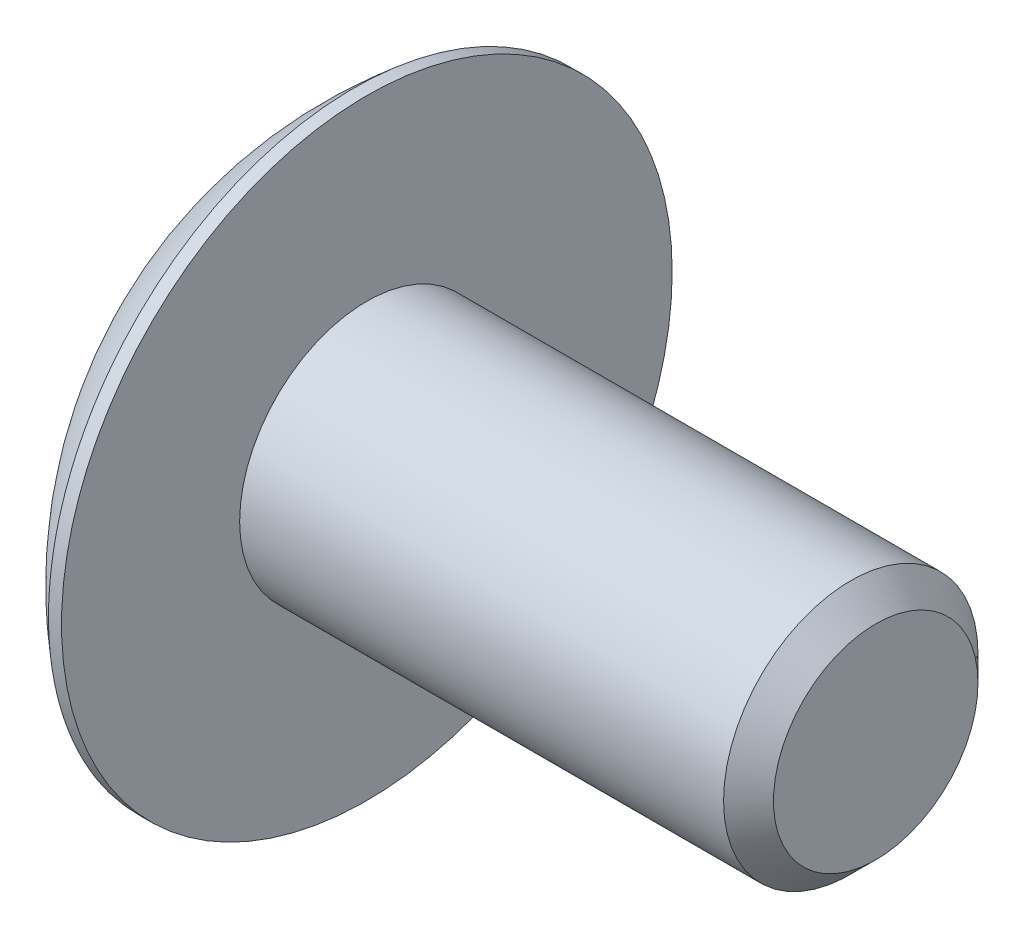
ISO-10303-21;
HEADER;
FILE_DESCRIPTION(('STEP AP214'),'2;1');
FILE_NAME('part.step','',(''),(''),'','','');
FILE_SCHEMA(('AUTOMOTIVE_DESIGN { 1 0 10303 214 1 1 1 1 }'));
ENDSEC;
DATA;
#1=APPLICATION_CONTEXT('core data for automotive mechanical design processes');
#2=APPLICATION_PROTOCOL_DEFINITION('international standard','automotive_design',2000,#1);
#3=PRODUCT_CONTEXT('',#1,'mechanical');
#4=PRODUCT('Part','Part','',(#3));
#5=PRODUCT_RELATED_PRODUCT_CATEGORY('part','',(#4));
#6=PRODUCT_DEFINITION_FORMATION('','',#4);
#7=PRODUCT_DEFINITION_CONTEXT('part definition',#1,'design');
#8=PRODUCT_DEFINITION('design','',#6,#7);
#9=PRODUCT_DEFINITION_SHAPE('','',#8);
#10=(LENGTH_UNIT() NAMED_UNIT(*) SI_UNIT(.MILLI.,.METRE.));
#11=(NAMED_UNIT(*) PLANE_ANGLE_UNIT() SI_UNIT($,.RADIAN.));
#12=(NAMED_UNIT(*) SI_UNIT($,.STERADIAN.) SOLID_ANGLE_UNIT());
#13=UNCERTAINTY_MEASURE_WITH_UNIT(LENGTH_MEASURE(1.E-05),#10,'distance_accuracy_value','');
#14=(GEOMETRIC_REPRESENTATION_CONTEXT(3) GLOBAL_UNCERTAINTY_ASSIGNED_CONTEXT((#13)) GLOBAL_UNIT_ASSIGNED_CONTEXT((#10,
#11,#12)) REPRESENTATION_CONTEXT('',''));
#15=CARTESIAN_POINT('',(0.,0.,0.));
#16=DIRECTION('',(0.,0.,1.));
#17=DIRECTION('',(1.,0.,0.));
#18=AXIS2_PLACEMENT_3D('',#15,#16,#17);
#19=CARTESIAN_POINT('',(0.,0.,0.));
#20=DIRECTION('',(-1.,0.,0.));
#21=DIRECTION('',(0.,0.,1.));
#22=AXIS2_PLACEMENT_3D('',#19,#20,#21);
#23=CYLINDRICAL_SURFACE('',#22,6.);
#24=CARTESIAN_POINT('',(0.,0.,0.));
#25=DIRECTION('',(1.,0.,0.));
#26=DIRECTION('',(0.,0.,-1.));
#27=AXIS2_PLACEMENT_3D('',#24,#25,#26);
#28=CIRCLE('',#27,6.);
#29=CARTESIAN_POINT('',(0.,0.,-6.));
#30=VERTEX_POINT('',#29);
#31=EDGE_CURVE('E199',#30,#30,#28,.T.);
#32=ORIENTED_EDGE('',*,*,#31,.F.);
#33=EDGE_LOOP('',(#32));
#34=FACE_BOUND('',#33,.T.);
#35=CARTESIAN_POINT('',(-0.25535421758715,0.,0.));
#36=DIRECTION('',(1.,0.,0.));
#37=DIRECTION('',(0.,0.,-1.));
#38=AXIS2_PLACEMENT_3D('',#35,#36,#37);
#39=CIRCLE('',#38,6.);
#40=CARTESIAN_POINT('',(-0.25535421758715,0.,-6.));
#41=VERTEX_POINT('',#40);
#42=EDGE_CURVE('E198',#41,#41,#39,.T.);
#43=ORIENTED_EDGE('',*,*,#42,.T.);
#44=EDGE_LOOP('',(#43));
#45=FACE_BOUND('',#44,.T.);
#46=ADVANCED_FACE('F40',(#34,#45),#23,.T.);
#47=CARTESIAN_POINT('',(0.,0.,0.));
#48=DIRECTION('',(1.,0.,0.));
#49=DIRECTION('',(0.,0.,-1.));
#50=AXIS2_PLACEMENT_3D('',#47,#48,#49);
#51=PLANE('',#50);
#52=CARTESIAN_POINT('',(0.,0.,0.));
#53=DIRECTION('',(1.,0.,0.));
#54=DIRECTION('',(0.,0.,-1.));
#55=AXIS2_PLACEMENT_3D('',#52,#53,#54);
#56=CIRCLE('',#55,2.5);
#57=CARTESIAN_POINT('',(0.,0.,-2.5));
#58=VERTEX_POINT('',#57);
#59=EDGE_CURVE('E176',#58,#58,#56,.T.);
#60=ORIENTED_EDGE('',*,*,#59,.F.);
#61=EDGE_LOOP('',(#60));
#62=FACE_BOUND('',#61,.T.);
#63=ORIENTED_EDGE('',*,*,#31,.T.);
#64=EDGE_LOOP('',(#63));
#65=FACE_BOUND('',#64,.T.);
#66=ADVANCED_FACE('F214',(#62,#65),#51,.T.);
#67=CARTESIAN_POINT('',(4.65,0.,0.));
#68=DIRECTION('',(0.,0.,1.));
#69=DIRECTION('',(1.,0.,0.));
#70=AXIS2_PLACEMENT_3D('',#67,#68,#69);
#71=SPHERICAL_SURFACE('',#70,7.75);
#72=CARTESIAN_POINT('',(4.65,0.,2.48));
#73=DIRECTION('',(0.,0.,1.));
#74=DIRECTION('',(1.,0.,0.));
#75=AXIS2_PLACEMENT_3D('',#72,#73,#74);
#76=CIRCLE('',#75,7.34248595504275);
#77=CARTESIAN_POINT('',(-2.66626270714776,-0.62,2.48));
#78=VERTEX_POINT('',#77);
#79=CARTESIAN_POINT('',(-2.66626270714769,0.62,2.48));
#80=VERTEX_POINT('',#79);
#81=EDGE_CURVE('E12',#78,#80,#76,.F.);
#82=ORIENTED_EDGE('',*,*,#81,.F.);
#83=CARTESIAN_POINT('',(-3.05024025599202,-0.620000000000001,0.619999999999999));
#84=CARTESIAN_POINT('',(-3.04385234972373,-0.62,0.699341389651456));
#85=CARTESIAN_POINT('',(-3.03623735234412,-0.62,0.778583943000289));
#86=CARTESIAN_POINT('',(-3.0185873647853,-0.62,0.936571433978313));
#87=CARTESIAN_POINT('',(-3.00855930205079,-0.62,1.01531714556652));
#88=CARTESIAN_POINT('',(-2.98610225584174,-0.62,1.1723135020403));
#89=CARTESIAN_POINT('',(-2.97367784849534,-0.62,1.25056480152207));
#90=CARTESIAN_POINT('',(-2.94644083884636,-0.62,1.40657410134143));
#91=CARTESIAN_POINT('',(-2.93163051496762,-0.62,1.48433249946642));
#92=CARTESIAN_POINT('',(-2.8996272398254,-0.62,1.63935742720942));
#93=CARTESIAN_POINT('',(-2.88243428856193,-0.62,1.71662395682742));
#94=CARTESIAN_POINT('',(-2.84566457906742,-0.62,1.87066533045294));
#95=CARTESIAN_POINT('',(-2.82608557115019,-0.62,1.94743963746688));
#96=CARTESIAN_POINT('',(-2.7845357860721,-0.62,2.10049449766558));
#97=CARTESIAN_POINT('',(-2.76256054766246,-0.62,2.17677383977456));
#98=CARTESIAN_POINT('',(-2.71620419200082,-0.62,2.32883520125778));
#99=CARTESIAN_POINT('',(-2.69181640713701,-0.620000000000001,2.40461518803378));
#100=CARTESIAN_POINT('',(-2.66626270714771,-0.620000000000002,2.47999999999994));
#101=B_SPLINE_CURVE_WITH_KNOTS('',3,(#83,#84,#85,#86,#87,#88,#89,#90,#91,#92,#93,#94,#95,#96,
#97,#98,#99,#100),.UNSPECIFIED.,.F.,.F.,(4,2,2,2,2,2,2,2,4),(0.,0.238784796436347,
0.47689209881778,0.714549127805222,0.951980537755273,1.18941194770532,1.42706897669277,
1.6651762790742,1.90396107551055),.UNSPECIFIED.);
#102=CARTESIAN_POINT('',(-3.05024025599202,-0.620000000000001,0.619999999999999));
#103=VERTEX_POINT('',#102);
#104=EDGE_CURVE('E130',#103,#78,#101,.T.);
#105=ORIENTED_EDGE('',*,*,#104,.F.);
#106=CARTESIAN_POINT('',(4.65,0.,0.62));
#107=DIRECTION('',(0.,0.,1.));
#108=DIRECTION('',(1.,0.,0.));
#109=AXIS2_PLACEMENT_3D('',#106,#107,#108);
#110=CIRCLE('',#109,7.72516019251381);
#111=CARTESIAN_POINT('',(-2.66626270714769,-2.48,0.62));
#112=VERTEX_POINT('',#111);
#113=EDGE_CURVE('E463',#112,#103,#110,.F.);
#114=ORIENTED_EDGE('',*,*,#113,.F.);
#115=CARTESIAN_POINT('',(-2.66626270714776,-2.47999999999993,-0.619999999999982));
#116=CARTESIAN_POINT('',(-2.68374487241121,-2.47999999999997,-0.413333333333318));
#117=CARTESIAN_POINT('',(-2.69248595504292,-2.47999999999999,-0.206666666666653));
#118=CARTESIAN_POINT('',(-2.6924859550429,-2.48000000000001,0.206666666666674));
#119=CARTESIAN_POINT('',(-2.68374487241116,-2.48000000000001,0.413333333333337));
#120=CARTESIAN_POINT('',(-2.66626270714769,-2.48,0.619999999999999));
#121=B_SPLINE_CURVE_WITH_KNOTS('',3,(#115,#116,#117,#118,#119,#120),.UNSPECIFIED.,.F.,.F.,(4,2,
4),(0.,0.620554315696991,1.24110863139398),.UNSPECIFIED.);
#122=CARTESIAN_POINT('',(-2.66626270714776,-2.48,-0.62));
#123=VERTEX_POINT('',#122);
#124=EDGE_CURVE('E228',#123,#112,#121,.T.);
#125=ORIENTED_EDGE('',*,*,#124,.F.);
#126=CARTESIAN_POINT('',(4.65,0.,-0.62));
#127=DIRECTION('',(0.,0.,1.));
#128=DIRECTION('',(1.,0.,0.));
#129=AXIS2_PLACEMENT_3D('',#126,#127,#128);
#130=CIRCLE('',#129,7.72516019251381);
#131=CARTESIAN_POINT('',(-3.05024025599202,-0.62,-0.62));
#132=VERTEX_POINT('',#131);
#133=EDGE_CURVE('E458',#132,#123,#130,.T.);
#134=ORIENTED_EDGE('',*,*,#133,.F.);
#135=CARTESIAN_POINT('',(-2.66626270714769,-0.62,-2.48));
#136=CARTESIAN_POINT('',(-2.69181640713699,-0.62,-2.40461518803384));
#137=CARTESIAN_POINT('',(-2.7162041920008,-0.62,-2.32883520125784));
#138=CARTESIAN_POINT('',(-2.76256054766245,-0.62,-2.17677383977461));
#139=CARTESIAN_POINT('',(-2.78453578607209,-0.62,-2.10049449766563));
#140=CARTESIAN_POINT('',(-2.82608557115018,-0.62,-1.94743963746692));
#141=CARTESIAN_POINT('',(-2.84566457906741,-0.62,-1.87066533045298));
#142=CARTESIAN_POINT('',(-2.88243428856192,-0.62,-1.71662395682746));
#143=CARTESIAN_POINT('',(-2.8996272398254,-0.62,-1.63935742720945));
#144=CARTESIAN_POINT('',(-2.93163051496761,-0.62,-1.48433249946645));
#145=CARTESIAN_POINT('',(-2.94644083884636,-0.62,-1.40657410134146));
#146=CARTESIAN_POINT('',(-2.97367784849534,-0.62,-1.25056480152209));
#147=CARTESIAN_POINT('',(-2.98610225584173,-0.62,-1.17231350204032));
#148=CARTESIAN_POINT('',(-3.00855930205079,-0.62,-1.01531714556653));
#149=CARTESIAN_POINT('',(-3.0185873647853,-0.62,-0.936571433978324));
#150=CARTESIAN_POINT('',(-3.03623735234412,-0.62,-0.778583943000294));
#151=CARTESIAN_POINT('',(-3.04385234972373,-0.620000000000001,-0.699341389651458));
#152=CARTESIAN_POINT('',(-3.05024025599202,-0.620000000000001,-0.62));
#153=B_SPLINE_CURVE_WITH_KNOTS('',3,(#135,#136,#137,#138,#139,#140,#141,#142,#143,#144,#145,
#146,#147,#148,#149,#150,#151,#152),.UNSPECIFIED.,.F.,.F.,(4,2,2,2,2,2,2,2,4),(0.,
0.238784796436356,0.476892098817797,0.714549127805245,0.951980537755305,1.18941194770536,
1.42706897669281,1.66517627907425,1.90396107551061),.UNSPECIFIED.);
#154=CARTESIAN_POINT('',(-2.66626270714769,-0.62,-2.48));
#155=VERTEX_POINT('',#154);
#156=EDGE_CURVE('E236',#155,#132,#153,.T.);
#157=ORIENTED_EDGE('',*,*,#156,.F.);
#158=CARTESIAN_POINT('',(4.65,0.,-2.48));
#159=DIRECTION('',(0.,0.,1.));
#160=DIRECTION('',(1.,0.,0.));
#161=AXIS2_PLACEMENT_3D('',#158,#159,#160);
#162=CIRCLE('',#161,7.34248595504275);
#163=CARTESIAN_POINT('',(-2.66626270714769,0.62,-2.48));
#164=VERTEX_POINT('',#163);
#165=EDGE_CURVE('E455',#164,#155,#162,.T.);
#166=ORIENTED_EDGE('',*,*,#165,.F.);
#167=CARTESIAN_POINT('',(-3.05024025599202,0.62,-0.62));
#168=CARTESIAN_POINT('',(-3.04385234972373,0.62,-0.699341389651459));
#169=CARTESIAN_POINT('',(-3.03623735234412,0.62,-0.778583943000295));
#170=CARTESIAN_POINT('',(-3.0185873647853,0.62,-0.936571433978325));
#171=CARTESIAN_POINT('',(-3.00855930205079,0.62,-1.01531714556653));
#172=CARTESIAN_POINT('',(-2.98610225584173,0.62,-1.17231350204032));
#173=CARTESIAN_POINT('',(-2.97367784849534,0.62,-1.25056480152209));
#174=CARTESIAN_POINT('',(-2.94644083884636,0.62,-1.40657410134146));
#175=CARTESIAN_POINT('',(-2.93163051496761,0.62,-1.48433249946645));
#176=CARTESIAN_POINT('',(-2.8996272398254,0.62,-1.63935742720945));
#177=CARTESIAN_POINT('',(-2.88243428856192,0.62,-1.71662395682746));
#178=CARTESIAN_POINT('',(-2.84566457906741,0.62,-1.87066533045298));
#179=CARTESIAN_POINT('',(-2.82608557115018,0.62,-1.94743963746692));
#180=CARTESIAN_POINT('',(-2.78453578607209,0.62,-2.10049449766563));
#181=CARTESIAN_POINT('',(-2.76256054766245,0.62,-2.17677383977461));
#182=CARTESIAN_POINT('',(-2.7162041920008,0.62,-2.32883520125784));
#183=CARTESIAN_POINT('',(-2.69181640713699,0.62,-2.40461518803384));
#184=CARTESIAN_POINT('',(-2.66626270714769,0.619999999999999,-2.48));
#185=B_SPLINE_CURVE_WITH_KNOTS('',3,(#167,#168,#169,#170,#171,#172,#173,#174,#175,#176,#177,
#178,#179,#180,#181,#182,#183,#184),.UNSPECIFIED.,.F.,.F.,(4,2,2,2,2,2,2,2,4),(0.,
0.238784796436355,0.476892098817796,0.714549127805245,0.951980537755304,1.18941194770536,
1.42706897669281,1.66517627907425,1.90396107551061),.UNSPECIFIED.);
#186=CARTESIAN_POINT('',(-3.05024025599202,0.62,-0.62));
#187=VERTEX_POINT('',#186);
#188=EDGE_CURVE('E243',#187,#164,#185,.T.);
#189=ORIENTED_EDGE('',*,*,#188,.F.);
#190=CARTESIAN_POINT('',(4.65,0.,-0.62));
#191=DIRECTION('',(0.,0.,1.));
#192=DIRECTION('',(1.,0.,0.));
#193=AXIS2_PLACEMENT_3D('',#190,#191,#192);
#194=CIRCLE('',#193,7.72516019251381);
#195=CARTESIAN_POINT('',(-2.66626270714769,2.48,-0.62));
#196=VERTEX_POINT('',#195);
#197=EDGE_CURVE('E257',#196,#187,#194,.T.);
#198=ORIENTED_EDGE('',*,*,#197,.F.);
#199=CARTESIAN_POINT('',(-2.66626270714769,2.48,0.62));
#200=CARTESIAN_POINT('',(-2.68374487241117,2.48,0.413333333333333));
#201=CARTESIAN_POINT('',(-2.69248595504291,2.48,0.206666666666666));
#202=CARTESIAN_POINT('',(-2.69248595504291,2.48,-0.206666666666667));
#203=CARTESIAN_POINT('',(-2.68374487241117,2.48,-0.413333333333333));
#204=CARTESIAN_POINT('',(-2.66626270714769,2.48,-0.62));
#205=B_SPLINE_CURVE_WITH_KNOTS('',3,(#199,#200,#201,#202,#203,#204),.UNSPECIFIED.,.F.,.F.,(4,2,
4),(0.,0.620554315697002,1.241108631394),.UNSPECIFIED.);
#206=CARTESIAN_POINT('',(-2.66626270714769,2.48,0.62));
#207=VERTEX_POINT('',#206);
#208=EDGE_CURVE('E250',#207,#196,#205,.T.);
#209=ORIENTED_EDGE('',*,*,#208,.F.);
#210=CARTESIAN_POINT('',(4.65,0.,0.62));
#211=DIRECTION('',(0.,0.,1.));
#212=DIRECTION('',(1.,0.,0.));
#213=AXIS2_PLACEMENT_3D('',#210,#211,#212);
#214=CIRCLE('',#213,7.72516019251381);
#215=CARTESIAN_POINT('',(-3.05024025599202,0.62,0.62));
#216=VERTEX_POINT('',#215);
#217=EDGE_CURVE('E256',#216,#207,#214,.F.);
#218=ORIENTED_EDGE('',*,*,#217,.F.);
#219=CARTESIAN_POINT('',(-2.66626270714769,0.620000000000003,2.47999999999999));
#220=CARTESIAN_POINT('',(-2.69181640713699,0.620000000000001,2.40461518803383));
#221=CARTESIAN_POINT('',(-2.71620419200081,0.62,2.32883520125783));
#222=CARTESIAN_POINT('',(-2.76256054766245,0.62,2.17677383977461));
#223=CARTESIAN_POINT('',(-2.78453578607209,0.62,2.10049449766562));
#224=CARTESIAN_POINT('',(-2.82608557115019,0.62,1.94743963746692));
#225=CARTESIAN_POINT('',(-2.84566457906741,0.62,1.87066533045297));
#226=CARTESIAN_POINT('',(-2.88243428856192,0.62,1.71662395682745));
#227=CARTESIAN_POINT('',(-2.8996272398254,0.62,1.63935742720945));
#228=CARTESIAN_POINT('',(-2.93163051496761,0.62,1.48433249946645));
#229=CARTESIAN_POINT('',(-2.94644083884636,0.62,1.40657410134145));
#230=CARTESIAN_POINT('',(-2.97367784849534,0.62,1.25056480152208));
#231=CARTESIAN_POINT('',(-2.98610225584173,0.62,1.17231350204032));
#232=CARTESIAN_POINT('',(-3.00855930205079,0.62,1.01531714556653));
#233=CARTESIAN_POINT('',(-3.0185873647853,0.62,0.936571433978322));
#234=CARTESIAN_POINT('',(-3.03623735234412,0.62,0.778583943000293));
#235=CARTESIAN_POINT('',(-3.04385234972373,0.62,0.699341389651457));
#236=CARTESIAN_POINT('',(-3.05024025599202,0.62,0.619999999999999));
#237=B_SPLINE_CURVE_WITH_KNOTS('',3,(#219,#220,#221,#222,#223,#224,#225,#226,#227,#228,#229,
#230,#231,#232,#233,#234,#235,#236),.UNSPECIFIED.,.F.,.F.,(4,2,2,2,2,2,2,2,4),(0.,
0.238784796436354,0.476892098817794,0.714549127805242,0.951980537755301,1.18941194770536,
1.42706897669281,1.66517627907425,1.9039610755106),.UNSPECIFIED.);
#238=EDGE_CURVE('E48',#80,#216,#237,.T.);
#239=ORIENTED_EDGE('',*,*,#238,.F.);
#240=EDGE_LOOP('',(#82,#105,#114,#125,#134,#157,#166,#189,#198,#209,#218,#239));
#241=FACE_BOUND('',#240,.T.);
#242=ORIENTED_EDGE('',*,*,#42,.F.);
#243=EDGE_LOOP('',(#242));
#244=FACE_BOUND('',#243,.T.);
#245=ADVANCED_FACE('F209',(#241,#244),#71,.T.);
#246=CARTESIAN_POINT('',(10.,0.,0.));
#247=DIRECTION('',(-1.,0.,0.));
#248=DIRECTION('',(0.,0.,1.));
#249=AXIS2_PLACEMENT_3D('',#246,#247,#248);
#250=CYLINDRICAL_SURFACE('',#249,2.5);
#251=CARTESIAN_POINT('',(9.50949999999945,0.,0.));
#252=DIRECTION('',(1.,0.,0.));
#253=DIRECTION('',(0.,0.,-1.));
#254=AXIS2_PLACEMENT_3D('',#251,#252,#253);
#255=CIRCLE('',#254,2.5);
#256=CARTESIAN_POINT('',(9.50949999999945,0.,-2.5));
#257=VERTEX_POINT('',#256);
#258=EDGE_CURVE('E467',#257,#257,#255,.F.);
#259=ORIENTED_EDGE('',*,*,#258,.T.);
#260=EDGE_LOOP('',(#259));
#261=FACE_BOUND('',#260,.T.);
#262=ORIENTED_EDGE('',*,*,#59,.T.);
#263=EDGE_LOOP('',(#262));
#264=FACE_BOUND('',#263,.T.);
#265=ADVANCED_FACE('F213',(#261,#264),#250,.T.);
#266=CARTESIAN_POINT('',(10.,0.,0.));
#267=DIRECTION('',(1.,0.,0.));
#268=DIRECTION('',(0.,0.,-1.));
#269=AXIS2_PLACEMENT_3D('',#266,#267,#268);
#270=PLANE('',#269);
#271=CARTESIAN_POINT('',(10.,0.,0.));
#272=DIRECTION('',(1.,0.,0.));
#273=DIRECTION('',(0.,0.,-1.));
#274=AXIS2_PLACEMENT_3D('',#271,#272,#273);
#275=CIRCLE('',#274,2.00949999999945);
#276=CARTESIAN_POINT('',(10.,0.,-2.00949999999945));
#277=VERTEX_POINT('',#276);
#278=EDGE_CURVE('E202',#277,#277,#275,.T.);
#279=ORIENTED_EDGE('',*,*,#278,.T.);
#280=EDGE_LOOP('',(#279));
#281=FACE_BOUND('',#280,.T.);
#282=ADVANCED_FACE('F299',(#281),#270,.T.);
#283=CARTESIAN_POINT('',(10.,0.,0.));
#284=DIRECTION('',(-1.,0.,0.));
#285=DIRECTION('',(0.,0.,1.));
#286=AXIS2_PLACEMENT_3D('',#283,#284,#285);
#287=CONICAL_SURFACE('',#286,2.00949999999945,0.785398163397446);
#288=ORIENTED_EDGE('',*,*,#258,.F.);
#289=EDGE_LOOP('',(#288));
#290=FACE_BOUND('',#289,.T.);
#291=ORIENTED_EDGE('',*,*,#278,.F.);
#292=EDGE_LOOP('',(#291));
#293=FACE_BOUND('',#292,.T.);
#294=ADVANCED_FACE('F42',(#290,#293),#287,.T.);
#295=CARTESIAN_POINT('',(-11.55,0.62,2.48));
#296=DIRECTION('',(0.,0.,1.));
#297=DIRECTION('',(0.,-1.,0.));
#298=AXIS2_PLACEMENT_3D('',#295,#296,#297);
#299=PLANE('',#298);
#300=ORIENTED_EDGE('',*,*,#81,.T.);
#301=DIRECTION('',(1.,0.,0.));
#302=VECTOR('',#301,1.);
#303=CARTESIAN_POINT('',(-11.55,0.62,2.48));
#304=LINE('',#303,#302);
#305=CARTESIAN_POINT('',(-1.55,0.62,2.48));
#306=VERTEX_POINT('',#305);
#307=EDGE_CURVE('E146',#80,#306,#304,.T.);
#308=ORIENTED_EDGE('',*,*,#307,.T.);
#309=DIRECTION('',(0.,-1.,0.));
#310=VECTOR('',#309,1.);
#311=CARTESIAN_POINT('',(-1.55,0.62,2.48));
#312=LINE('',#311,#310);
#313=CARTESIAN_POINT('',(-1.55,-0.62,2.48));
#314=VERTEX_POINT('',#313);
#315=EDGE_CURVE('E139',#306,#314,#312,.T.);
#316=ORIENTED_EDGE('',*,*,#315,.T.);
#317=DIRECTION('',(1.,0.,0.));
#318=VECTOR('',#317,1.);
#319=CARTESIAN_POINT('',(-11.55,-0.62,2.48));
#320=LINE('',#319,#318);
#321=EDGE_CURVE('E125',#78,#314,#320,.T.);
#322=ORIENTED_EDGE('',*,*,#321,.F.);
#323=EDGE_LOOP('',(#300,#308,#316,#322));
#324=FACE_BOUND('',#323,.T.);
#325=ADVANCED_FACE('F145',(#324),#299,.F.);
#326=CARTESIAN_POINT('',(-11.55,0.62,0.62));
#327=DIRECTION('',(0.,1.,0.));
#328=DIRECTION('',(0.,0.,1.));
#329=AXIS2_PLACEMENT_3D('',#326,#327,#328);
#330=PLANE('',#329);
#331=ORIENTED_EDGE('',*,*,#238,.T.);
#332=DIRECTION('',(1.,0.,0.));
#333=VECTOR('',#332,1.);
#334=CARTESIAN_POINT('',(-11.55,0.62,0.62));
#335=LINE('',#334,#333);
#336=CARTESIAN_POINT('',(-1.55,0.62,0.62));
#337=VERTEX_POINT('',#336);
#338=EDGE_CURVE('E177',#216,#337,#335,.T.);
#339=ORIENTED_EDGE('',*,*,#338,.T.);
#340=DIRECTION('',(0.,0.,1.));
#341=VECTOR('',#340,1.);
#342=CARTESIAN_POINT('',(-1.55,0.62,0.62));
#343=LINE('',#342,#341);
#344=EDGE_CURVE('E132',#337,#306,#343,.T.);
#345=ORIENTED_EDGE('',*,*,#344,.T.);
#346=ORIENTED_EDGE('',*,*,#307,.F.);
#347=EDGE_LOOP('',(#331,#339,#345,#346));
#348=FACE_BOUND('',#347,.T.);
#349=ADVANCED_FACE('F298',(#348),#330,.F.);
#350=CARTESIAN_POINT('',(-11.55,2.48,0.62));
#351=DIRECTION('',(0.,0.,1.));
#352=DIRECTION('',(0.,-1.,0.));
#353=AXIS2_PLACEMENT_3D('',#350,#351,#352);
#354=PLANE('',#353);
#355=ORIENTED_EDGE('',*,*,#217,.T.);
#356=DIRECTION('',(1.,0.,0.));
#357=VECTOR('',#356,1.);
#358=CARTESIAN_POINT('',(-11.55,2.48,0.62));
#359=LINE('',#358,#357);
#360=CARTESIAN_POINT('',(-1.55,2.48,0.62));
#361=VERTEX_POINT('',#360);
#362=EDGE_CURVE('E179',#207,#361,#359,.T.);
#363=ORIENTED_EDGE('',*,*,#362,.T.);
#364=DIRECTION('',(0.,-1.,0.));
#365=VECTOR('',#364,1.);
#366=CARTESIAN_POINT('',(-1.55,2.48,0.62));
#367=LINE('',#366,#365);
#368=EDGE_CURVE('E171',#361,#337,#367,.T.);
#369=ORIENTED_EDGE('',*,*,#368,.T.);
#370=ORIENTED_EDGE('',*,*,#338,.F.);
#371=EDGE_LOOP('',(#355,#363,#369,#370));
#372=FACE_BOUND('',#371,.T.);
#373=ADVANCED_FACE('F264',(#372),#354,.F.);
#374=CARTESIAN_POINT('',(-11.55,2.48,-0.62));
#375=DIRECTION('',(0.,1.,0.));
#376=DIRECTION('',(0.,0.,1.));
#377=AXIS2_PLACEMENT_3D('',#374,#375,#376);
#378=PLANE('',#377);
#379=ORIENTED_EDGE('',*,*,#208,.T.);
#380=DIRECTION('',(1.,0.,0.));
#381=VECTOR('',#380,1.);
#382=CARTESIAN_POINT('',(-11.55,2.48,-0.62));
#383=LINE('',#382,#381);
#384=CARTESIAN_POINT('',(-1.55,2.48,-0.62));
#385=VERTEX_POINT('',#384);
#386=EDGE_CURVE('E181',#196,#385,#383,.T.);
#387=ORIENTED_EDGE('',*,*,#386,.T.);
#388=DIRECTION('',(0.,0.,1.));
#389=VECTOR('',#388,1.);
#390=CARTESIAN_POINT('',(-1.55,2.48,-0.62));
#391=LINE('',#390,#389);
#392=EDGE_CURVE('E168',#385,#361,#391,.T.);
#393=ORIENTED_EDGE('',*,*,#392,.T.);
#394=ORIENTED_EDGE('',*,*,#362,.F.);
#395=EDGE_LOOP('',(#379,#387,#393,#394));
#396=FACE_BOUND('',#395,.T.);
#397=ADVANCED_FACE('F258',(#396),#378,.F.);
#398=CARTESIAN_POINT('',(-11.55,0.62,-0.62));
#399=DIRECTION('',(0.,0.,-1.));
#400=DIRECTION('',(0.,1.,0.));
#401=AXIS2_PLACEMENT_3D('',#398,#399,#400);
#402=PLANE('',#401);
#403=ORIENTED_EDGE('',*,*,#197,.T.);
#404=DIRECTION('',(1.,0.,0.));
#405=VECTOR('',#404,1.);
#406=CARTESIAN_POINT('',(-11.55,0.62,-0.62));
#407=LINE('',#406,#405);
#408=CARTESIAN_POINT('',(-1.55,0.62,-0.62));
#409=VERTEX_POINT('',#408);
#410=EDGE_CURVE('E183',#187,#409,#407,.T.);
#411=ORIENTED_EDGE('',*,*,#410,.T.);
#412=DIRECTION('',(0.,1.,0.));
#413=VECTOR('',#412,1.);
#414=CARTESIAN_POINT('',(-1.55,0.62,-0.62));
#415=LINE('',#414,#413);
#416=EDGE_CURVE('E165',#409,#385,#415,.T.);
#417=ORIENTED_EDGE('',*,*,#416,.T.);
#418=ORIENTED_EDGE('',*,*,#386,.F.);
#419=EDGE_LOOP('',(#403,#411,#417,#418));
#420=FACE_BOUND('',#419,.T.);
#421=ADVANCED_FACE('F263',(#420),#402,.F.);
#422=CARTESIAN_POINT('',(-11.55,0.62,-2.48));
#423=DIRECTION('',(0.,1.,0.));
#424=DIRECTION('',(0.,0.,1.));
#425=AXIS2_PLACEMENT_3D('',#422,#423,#424);
#426=PLANE('',#425);
#427=ORIENTED_EDGE('',*,*,#188,.T.);
#428=DIRECTION('',(1.,0.,0.));
#429=VECTOR('',#428,1.);
#430=CARTESIAN_POINT('',(-11.55,0.62,-2.48));
#431=LINE('',#430,#429);
#432=CARTESIAN_POINT('',(-1.55,0.62,-2.48));
#433=VERTEX_POINT('',#432);
#434=EDGE_CURVE('E185',#164,#433,#431,.T.);
#435=ORIENTED_EDGE('',*,*,#434,.T.);
#436=DIRECTION('',(0.,0.,1.));
#437=VECTOR('',#436,1.);
#438=CARTESIAN_POINT('',(-1.55,0.62,-2.48));
#439=LINE('',#438,#437);
#440=EDGE_CURVE('E162',#433,#409,#439,.T.);
#441=ORIENTED_EDGE('',*,*,#440,.T.);
#442=ORIENTED_EDGE('',*,*,#410,.F.);
#443=EDGE_LOOP('',(#427,#435,#441,#442));
#444=FACE_BOUND('',#443,.T.);
#445=ADVANCED_FACE('F268',(#444),#426,.F.);
#446=CARTESIAN_POINT('',(-11.55,-0.62,-2.48));
#447=DIRECTION('',(0.,0.,-1.));
#448=DIRECTION('',(0.,1.,0.));
#449=AXIS2_PLACEMENT_3D('',#446,#447,#448);
#450=PLANE('',#449);
#451=ORIENTED_EDGE('',*,*,#165,.T.);
#452=DIRECTION('',(1.,0.,0.));
#453=VECTOR('',#452,1.);
#454=CARTESIAN_POINT('',(-11.55,-0.62,-2.48));
#455=LINE('',#454,#453);
#456=CARTESIAN_POINT('',(-1.55,-0.62,-2.48));
#457=VERTEX_POINT('',#456);
#458=EDGE_CURVE('E187',#155,#457,#455,.T.);
#459=ORIENTED_EDGE('',*,*,#458,.T.);
#460=DIRECTION('',(0.,1.,0.));
#461=VECTOR('',#460,1.);
#462=CARTESIAN_POINT('',(-1.55,-0.62,-2.48));
#463=LINE('',#462,#461);
#464=EDGE_CURVE('E159',#457,#433,#463,.T.);
#465=ORIENTED_EDGE('',*,*,#464,.T.);
#466=ORIENTED_EDGE('',*,*,#434,.F.);
#467=EDGE_LOOP('',(#451,#459,#465,#466));
#468=FACE_BOUND('',#467,.T.);
#469=ADVANCED_FACE('F273',(#468),#450,.F.);
#470=CARTESIAN_POINT('',(-11.55,-0.62,-0.62));
#471=DIRECTION('',(0.,-1.,0.));
#472=DIRECTION('',(0.,0.,-1.));
#473=AXIS2_PLACEMENT_3D('',#470,#471,#472);
#474=PLANE('',#473);
#475=ORIENTED_EDGE('',*,*,#156,.T.);
#476=DIRECTION('',(1.,0.,0.));
#477=VECTOR('',#476,1.);
#478=CARTESIAN_POINT('',(-11.55,-0.62,-0.62));
#479=LINE('',#478,#477);
#480=CARTESIAN_POINT('',(-1.55,-0.62,-0.62));
#481=VERTEX_POINT('',#480);
#482=EDGE_CURVE('E189',#132,#481,#479,.T.);
#483=ORIENTED_EDGE('',*,*,#482,.T.);
#484=DIRECTION('',(0.,0.,-1.));
#485=VECTOR('',#484,1.);
#486=CARTESIAN_POINT('',(-1.55,-0.62,-0.62));
#487=LINE('',#486,#485);
#488=EDGE_CURVE('E156',#481,#457,#487,.T.);
#489=ORIENTED_EDGE('',*,*,#488,.T.);
#490=ORIENTED_EDGE('',*,*,#458,.F.);
#491=EDGE_LOOP('',(#475,#483,#489,#490));
#492=FACE_BOUND('',#491,.T.);
#493=ADVANCED_FACE('F276',(#492),#474,.F.);
#494=CARTESIAN_POINT('',(-11.55,-2.48,-0.62));
#495=DIRECTION('',(0.,0.,-1.));
#496=DIRECTION('',(-1.,0.,0.));
#497=AXIS2_PLACEMENT_3D('',#494,#495,#496);
#498=PLANE('',#497);
#499=ORIENTED_EDGE('',*,*,#133,.T.);
#500=DIRECTION('',(1.,0.,0.));
#501=VECTOR('',#500,1.);
#502=CARTESIAN_POINT('',(-11.55,-2.48,-0.62));
#503=LINE('',#502,#501);
#504=CARTESIAN_POINT('',(-1.55,-2.48,-0.62));
#505=VERTEX_POINT('',#504);
#506=EDGE_CURVE('E191',#123,#505,#503,.T.);
#507=ORIENTED_EDGE('',*,*,#506,.T.);
#508=DIRECTION('',(0.,1.,0.));
#509=VECTOR('',#508,1.);
#510=CARTESIAN_POINT('',(-1.55,-2.48,-0.62));
#511=LINE('',#510,#509);
#512=EDGE_CURVE('E153',#505,#481,#511,.T.);
#513=ORIENTED_EDGE('',*,*,#512,.T.);
#514=ORIENTED_EDGE('',*,*,#482,.F.);
#515=EDGE_LOOP('',(#499,#507,#513,#514));
#516=FACE_BOUND('',#515,.T.);
#517=ADVANCED_FACE('F281',(#516),#498,.F.);
#518=CARTESIAN_POINT('',(-11.55,-2.48,0.62));
#519=DIRECTION('',(0.,-1.,0.));
#520=DIRECTION('',(0.,0.,-1.));
#521=AXIS2_PLACEMENT_3D('',#518,#519,#520);
#522=PLANE('',#521);
#523=ORIENTED_EDGE('',*,*,#124,.T.);
#524=DIRECTION('',(1.,0.,0.));
#525=VECTOR('',#524,1.);
#526=CARTESIAN_POINT('',(-11.55,-2.48,0.62));
#527=LINE('',#526,#525);
#528=CARTESIAN_POINT('',(-1.55,-2.48,0.62));
#529=VERTEX_POINT('',#528);
#530=EDGE_CURVE('E193',#112,#529,#527,.T.);
#531=ORIENTED_EDGE('',*,*,#530,.T.);
#532=DIRECTION('',(0.,0.,-1.));
#533=VECTOR('',#532,1.);
#534=CARTESIAN_POINT('',(-1.55,-2.48,0.62));
#535=LINE('',#534,#533);
#536=EDGE_CURVE('E150',#529,#505,#535,.T.);
#537=ORIENTED_EDGE('',*,*,#536,.T.);
#538=ORIENTED_EDGE('',*,*,#506,.F.);
#539=EDGE_LOOP('',(#523,#531,#537,#538));
#540=FACE_BOUND('',#539,.T.);
#541=ADVANCED_FACE('F284',(#540),#522,.F.);
#542=CARTESIAN_POINT('',(-11.55,-0.62,0.62));
#543=DIRECTION('',(0.,0.,1.));
#544=DIRECTION('',(1.,0.,0.));
#545=AXIS2_PLACEMENT_3D('',#542,#543,#544);
#546=PLANE('',#545);
#547=ORIENTED_EDGE('',*,*,#113,.T.);
#548=DIRECTION('',(1.,0.,0.));
#549=VECTOR('',#548,1.);
#550=CARTESIAN_POINT('',(-11.55,-0.62,0.62));
#551=LINE('',#550,#549);
#552=CARTESIAN_POINT('',(-1.55,-0.62,0.62));
#553=VERTEX_POINT('',#552);
#554=EDGE_CURVE('E55',#103,#553,#551,.T.);
#555=ORIENTED_EDGE('',*,*,#554,.T.);
#556=DIRECTION('',(0.,-1.,0.));
#557=VECTOR('',#556,1.);
#558=CARTESIAN_POINT('',(-1.55,-0.62,0.62));
#559=LINE('',#558,#557);
#560=EDGE_CURVE('E143',#553,#529,#559,.T.);
#561=ORIENTED_EDGE('',*,*,#560,.T.);
#562=ORIENTED_EDGE('',*,*,#530,.F.);
#563=EDGE_LOOP('',(#547,#555,#561,#562));
#564=FACE_BOUND('',#563,.T.);
#565=ADVANCED_FACE('F289',(#564),#546,.F.);
#566=CARTESIAN_POINT('',(-11.55,-0.62,2.48));
#567=DIRECTION('',(0.,-1.,0.));
#568=DIRECTION('',(0.,0.,-1.));
#569=AXIS2_PLACEMENT_3D('',#566,#567,#568);
#570=PLANE('',#569);
#571=ORIENTED_EDGE('',*,*,#104,.T.);
#572=ORIENTED_EDGE('',*,*,#321,.T.);
#573=DIRECTION('',(0.,0.,-1.));
#574=VECTOR('',#573,1.);
#575=CARTESIAN_POINT('',(-1.55,-0.62,2.48));
#576=LINE('',#575,#574);
#577=EDGE_CURVE('E128',#314,#553,#576,.T.);
#578=ORIENTED_EDGE('',*,*,#577,.T.);
#579=ORIENTED_EDGE('',*,*,#554,.F.);
#580=EDGE_LOOP('',(#571,#572,#578,#579));
#581=FACE_BOUND('',#580,.T.);
#582=ADVANCED_FACE('F127',(#581),#570,.F.);
#583=CARTESIAN_POINT('',(-1.55,0.,0.));
#584=DIRECTION('',(1.,0.,0.));
#585=DIRECTION('',(0.,0.,-1.));
#586=AXIS2_PLACEMENT_3D('',#583,#584,#585);
#587=PLANE('',#586);
#588=ORIENTED_EDGE('',*,*,#315,.F.);
#589=ORIENTED_EDGE('',*,*,#344,.F.);
#590=ORIENTED_EDGE('',*,*,#368,.F.);
#591=ORIENTED_EDGE('',*,*,#392,.F.);
#592=ORIENTED_EDGE('',*,*,#416,.F.);
#593=ORIENTED_EDGE('',*,*,#440,.F.);
#594=ORIENTED_EDGE('',*,*,#464,.F.);
#595=ORIENTED_EDGE('',*,*,#488,.F.);
#596=ORIENTED_EDGE('',*,*,#512,.F.);
#597=ORIENTED_EDGE('',*,*,#536,.F.);
#598=ORIENTED_EDGE('',*,*,#560,.F.);
#599=ORIENTED_EDGE('',*,*,#577,.F.);
#600=EDGE_LOOP('',(#588,#589,#590,#591,#592,#593,#594,#595,#596,#597,#598,#599));
#601=FACE_BOUND('',#600,.T.);
#602=ADVANCED_FACE('F137',(#601),#587,.F.);
#603=CLOSED_SHELL('',(#46,#66,#245,#265,#282,#294,#325,#349,#373,#397,#421,#445,#469,#493,#517,
#541,#565,#582,#602));
#604=MANIFOLD_SOLID_BREP('B2',#603);
#605=ADVANCED_BREP_SHAPE_REPRESENTATION('',(#18,#604),#14);
#606=SHAPE_DEFINITION_REPRESENTATION(#9,#605);
ENDSEC;
END-ISO-10303-21;
